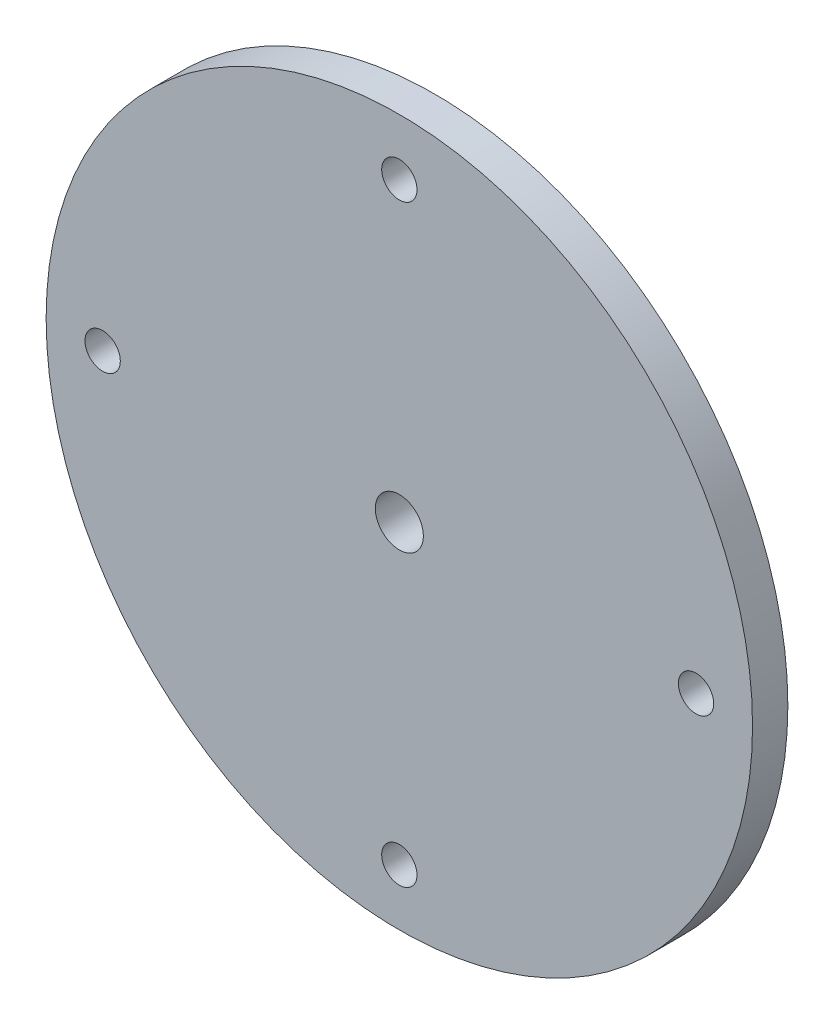
ISO-10303-21;
HEADER;
FILE_DESCRIPTION(('STEP AP214'),'2;1');
FILE_NAME('part.step','',(''),(''),'','','');
FILE_SCHEMA(('AUTOMOTIVE_DESIGN { 1 0 10303 214 1 1 1 1 }'));
ENDSEC;
DATA;
#1=APPLICATION_CONTEXT('core data for automotive mechanical design processes');
#2=APPLICATION_PROTOCOL_DEFINITION('international standard','automotive_design',2000,#1);
#3=PRODUCT_CONTEXT('',#1,'mechanical');
#4=PRODUCT('Part','Part','',(#3));
#5=PRODUCT_RELATED_PRODUCT_CATEGORY('part','',(#4));
#6=PRODUCT_DEFINITION_FORMATION('','',#4);
#7=PRODUCT_DEFINITION_CONTEXT('part definition',#1,'design');
#8=PRODUCT_DEFINITION('design','',#6,#7);
#9=PRODUCT_DEFINITION_SHAPE('','',#8);
#10=(LENGTH_UNIT() NAMED_UNIT(*) SI_UNIT(.MILLI.,.METRE.));
#11=(NAMED_UNIT(*) PLANE_ANGLE_UNIT() SI_UNIT($,.RADIAN.));
#12=(NAMED_UNIT(*) SI_UNIT($,.STERADIAN.) SOLID_ANGLE_UNIT());
#13=UNCERTAINTY_MEASURE_WITH_UNIT(LENGTH_MEASURE(1.E-05),#10,'distance_accuracy_value','');
#14=(GEOMETRIC_REPRESENTATION_CONTEXT(3) GLOBAL_UNCERTAINTY_ASSIGNED_CONTEXT((#13)) GLOBAL_UNIT_ASSIGNED_CONTEXT((#10,
#11,#12)) REPRESENTATION_CONTEXT('',''));
#15=CARTESIAN_POINT('',(0.,0.,0.));
#16=DIRECTION('',(0.,0.,1.));
#17=DIRECTION('',(1.,0.,0.));
#18=AXIS2_PLACEMENT_3D('',#15,#16,#17);
#19=CARTESIAN_POINT('',(0.,0.,2.));
#20=DIRECTION('',(0.,0.,-1.));
#21=DIRECTION('',(-1.,0.,0.));
#22=AXIS2_PLACEMENT_3D('',#19,#20,#21);
#23=CYLINDRICAL_SURFACE('',#22,14.);
#24=CARTESIAN_POINT('',(0.,0.,1.));
#25=DIRECTION('',(0.,0.,1.));
#26=DIRECTION('',(1.,0.,0.));
#27=AXIS2_PLACEMENT_3D('',#24,#25,#26);
#28=CIRCLE('',#27,14.);
#29=CARTESIAN_POINT('',(14.,0.,1.));
#30=VERTEX_POINT('',#29);
#31=EDGE_CURVE('E11',#30,#30,#28,.F.);
#32=ORIENTED_EDGE('',*,*,#31,.T.);
#33=EDGE_LOOP('',(#32));
#34=FACE_BOUND('',#33,.T.);
#35=CARTESIAN_POINT('',(0.,0.,0.));
#36=DIRECTION('',(0.,0.,1.));
#37=DIRECTION('',(1.,0.,0.));
#38=AXIS2_PLACEMENT_3D('',#35,#36,#37);
#39=CIRCLE('',#38,14.);
#40=CARTESIAN_POINT('',(14.,0.,0.));
#41=VERTEX_POINT('',#40);
#42=EDGE_CURVE('E123',#41,#41,#39,.T.);
#43=ORIENTED_EDGE('',*,*,#42,.T.);
#44=EDGE_LOOP('',(#43));
#45=FACE_BOUND('',#44,.T.);
#46=ADVANCED_FACE('F43',(#34,#45),#23,.T.);
#47=CARTESIAN_POINT('',(0.,0.,0.));
#48=DIRECTION('',(0.,0.,1.));
#49=DIRECTION('',(1.,0.,0.));
#50=AXIS2_PLACEMENT_3D('',#47,#48,#49);
#51=PLANE('',#50);
#52=ORIENTED_EDGE('',*,*,#42,.F.);
#53=EDGE_LOOP('',(#52));
#54=FACE_BOUND('',#53,.T.);
#55=CARTESIAN_POINT('',(0.,0.,0.));
#56=DIRECTION('',(0.,0.,1.));
#57=DIRECTION('',(1.,0.,0.));
#58=AXIS2_PLACEMENT_3D('',#55,#56,#57);
#59=CIRCLE('',#58,12.5);
#60=CARTESIAN_POINT('',(12.5,0.,0.));
#61=VERTEX_POINT('',#60);
#62=EDGE_CURVE('E113',#61,#61,#59,.T.);
#63=ORIENTED_EDGE('',*,*,#62,.T.);
#64=EDGE_LOOP('',(#63));
#65=FACE_BOUND('',#64,.T.);
#66=ADVANCED_FACE('F155',(#54,#65),#51,.F.);
#67=CARTESIAN_POINT('',(0.,0.,2.));
#68=DIRECTION('',(0.,0.,-1.));
#69=DIRECTION('',(-1.,0.,0.));
#70=AXIS2_PLACEMENT_3D('',#67,#68,#69);
#71=CYLINDRICAL_SURFACE('',#70,12.5);
#72=CARTESIAN_POINT('',(0.,0.,2.));
#73=DIRECTION('',(0.,0.,1.));
#74=DIRECTION('',(1.,0.,0.));
#75=AXIS2_PLACEMENT_3D('',#72,#73,#74);
#76=CIRCLE('',#75,12.5);
#77=CARTESIAN_POINT('',(8.83883476483185,8.83883476483184,2.));
#78=VERTEX_POINT('',#77);
#79=CARTESIAN_POINT('',(-8.83883476483185,8.83883476483184,2.));
#80=VERTEX_POINT('',#79);
#81=EDGE_CURVE('E119',#78,#80,#76,.T.);
#82=ORIENTED_EDGE('',*,*,#81,.T.);
#83=CARTESIAN_POINT('',(-8.83883476483185,-8.83883476483185,2.));
#84=VERTEX_POINT('',#83);
#85=EDGE_CURVE('E124',#80,#84,#76,.T.);
#86=ORIENTED_EDGE('',*,*,#85,.T.);
#87=CARTESIAN_POINT('',(8.83883476483184,-8.83883476483185,2.));
#88=VERTEX_POINT('',#87);
#89=EDGE_CURVE('E275',#84,#88,#76,.T.);
#90=ORIENTED_EDGE('',*,*,#89,.T.);
#91=EDGE_CURVE('E125',#88,#78,#76,.T.);
#92=ORIENTED_EDGE('',*,*,#91,.T.);
#93=EDGE_LOOP('',(#82,#86,#90,#92));
#94=FACE_BOUND('',#93,.T.);
#95=ORIENTED_EDGE('',*,*,#62,.F.);
#96=EDGE_LOOP('',(#95));
#97=FACE_BOUND('',#96,.T.);
#98=ADVANCED_FACE('F160',(#94,#97),#71,.F.);
#99=CARTESIAN_POINT('',(0.,0.,2.));
#100=DIRECTION('',(0.,0.,1.));
#101=DIRECTION('',(1.,0.,0.));
#102=AXIS2_PLACEMENT_3D('',#99,#100,#101);
#103=PLANE('',#102);
#104=ORIENTED_EDGE('',*,*,#81,.F.);
#105=DIRECTION('',(-1.,0.,0.));
#106=VECTOR('',#105,1.);
#107=CARTESIAN_POINT('',(-8.83883476483185,8.83883476483184,2.));
#108=LINE('',#107,#106);
#109=EDGE_CURVE('E262',#78,#80,#108,.T.);
#110=ORIENTED_EDGE('',*,*,#109,.T.);
#111=EDGE_LOOP('',(#104,#110));
#112=FACE_BOUND('',#111,.T.);
#113=ADVANCED_FACE('F167',(#112),#103,.F.);
#114=ORIENTED_EDGE('',*,*,#85,.F.);
#115=DIRECTION('',(0.,-1.,0.));
#116=VECTOR('',#115,1.);
#117=CARTESIAN_POINT('',(-8.83883476483185,-8.83883476483185,2.));
#118=LINE('',#117,#116);
#119=EDGE_CURVE('E106',#80,#84,#118,.T.);
#120=ORIENTED_EDGE('',*,*,#119,.T.);
#121=EDGE_LOOP('',(#114,#120));
#122=FACE_BOUND('',#121,.T.);
#123=ADVANCED_FACE('F284',(#122),#103,.F.);
#124=ORIENTED_EDGE('',*,*,#89,.F.);
#125=DIRECTION('',(1.,0.,0.));
#126=VECTOR('',#125,1.);
#127=CARTESIAN_POINT('',(-8.83883476483185,-8.83883476483185,2.));
#128=LINE('',#127,#126);
#129=EDGE_CURVE('E256',#84,#88,#128,.T.);
#130=ORIENTED_EDGE('',*,*,#129,.T.);
#131=EDGE_LOOP('',(#124,#130));
#132=FACE_BOUND('',#131,.T.);
#133=ADVANCED_FACE('F173',(#132),#103,.F.);
#134=ORIENTED_EDGE('',*,*,#91,.F.);
#135=DIRECTION('',(0.,1.,0.));
#136=VECTOR('',#135,1.);
#137=CARTESIAN_POINT('',(8.83883476483184,-8.83883476483185,2.));
#138=LINE('',#137,#136);
#139=EDGE_CURVE('E58',#88,#78,#138,.T.);
#140=ORIENTED_EDGE('',*,*,#139,.T.);
#141=EDGE_LOOP('',(#134,#140));
#142=FACE_BOUND('',#141,.T.);
#143=ADVANCED_FACE('F169',(#142),#103,.F.);
#144=CARTESIAN_POINT('',(8.83883476483184,-8.83883476483185,7.));
#145=DIRECTION('',(-1.,0.,0.));
#146=DIRECTION('',(0.,0.,1.));
#147=AXIS2_PLACEMENT_3D('',#144,#145,#146);
#148=PLANE('',#147);
#149=ORIENTED_EDGE('',*,*,#139,.F.);
#150=DIRECTION('',(0.,0.,-1.));
#151=VECTOR('',#150,1.);
#152=CARTESIAN_POINT('',(8.83883476483184,-8.83883476483185,7.));
#153=LINE('',#152,#151);
#154=CARTESIAN_POINT('',(8.83883476483184,-8.83883476483185,7.));
#155=VERTEX_POINT('',#154);
#156=EDGE_CURVE('E115',#155,#88,#153,.T.);
#157=ORIENTED_EDGE('',*,*,#156,.F.);
#158=DIRECTION('',(0.,1.,0.));
#159=VECTOR('',#158,1.);
#160=CARTESIAN_POINT('',(8.83883476483184,-8.83883476483185,7.));
#161=LINE('',#160,#159);
#162=CARTESIAN_POINT('',(8.83883476483184,8.83883476483184,7.));
#163=VERTEX_POINT('',#162);
#164=EDGE_CURVE('E102',#155,#163,#161,.T.);
#165=ORIENTED_EDGE('',*,*,#164,.T.);
#166=DIRECTION('',(0.,0.,-1.));
#167=VECTOR('',#166,1.);
#168=CARTESIAN_POINT('',(8.83883476483184,8.83883476483184,7.));
#169=LINE('',#168,#167);
#170=EDGE_CURVE('E100',#163,#78,#169,.T.);
#171=ORIENTED_EDGE('',*,*,#170,.T.);
#172=EDGE_LOOP('',(#149,#157,#165,#171));
#173=FACE_BOUND('',#172,.T.);
#174=ADVANCED_FACE('F172',(#173),#148,.T.);
#175=CARTESIAN_POINT('',(-8.83883476483185,8.83883476483184,7.));
#176=DIRECTION('',(0.,-1.,0.));
#177=DIRECTION('',(0.,0.,-1.));
#178=AXIS2_PLACEMENT_3D('',#175,#176,#177);
#179=PLANE('',#178);
#180=ORIENTED_EDGE('',*,*,#109,.F.);
#181=ORIENTED_EDGE('',*,*,#170,.F.);
#182=DIRECTION('',(-1.,0.,0.));
#183=VECTOR('',#182,1.);
#184=CARTESIAN_POINT('',(-8.83883476483185,8.83883476483184,7.));
#185=LINE('',#184,#183);
#186=CARTESIAN_POINT('',(-8.83883476483185,8.83883476483184,7.));
#187=VERTEX_POINT('',#186);
#188=EDGE_CURVE('E86',#163,#187,#185,.T.);
#189=ORIENTED_EDGE('',*,*,#188,.T.);
#190=DIRECTION('',(0.,0.,-1.));
#191=VECTOR('',#190,1.);
#192=CARTESIAN_POINT('',(-8.83883476483185,8.83883476483184,7.));
#193=LINE('',#192,#191);
#194=EDGE_CURVE('E98',#187,#80,#193,.T.);
#195=ORIENTED_EDGE('',*,*,#194,.T.);
#196=EDGE_LOOP('',(#180,#181,#189,#195));
#197=FACE_BOUND('',#196,.T.);
#198=ADVANCED_FACE('F97',(#197),#179,.T.);
#199=CARTESIAN_POINT('',(-8.83883476483185,-8.83883476483185,7.));
#200=DIRECTION('',(1.,0.,0.));
#201=DIRECTION('',(0.,0.,-1.));
#202=AXIS2_PLACEMENT_3D('',#199,#200,#201);
#203=PLANE('',#202);
#204=ORIENTED_EDGE('',*,*,#119,.F.);
#205=ORIENTED_EDGE('',*,*,#194,.F.);
#206=DIRECTION('',(0.,-1.,0.));
#207=VECTOR('',#206,1.);
#208=CARTESIAN_POINT('',(-8.83883476483185,-8.83883476483185,7.));
#209=LINE('',#208,#207);
#210=CARTESIAN_POINT('',(-8.83883476483185,-8.83883476483185,7.));
#211=VERTEX_POINT('',#210);
#212=EDGE_CURVE('E83',#187,#211,#209,.T.);
#213=ORIENTED_EDGE('',*,*,#212,.T.);
#214=DIRECTION('',(0.,0.,-1.));
#215=VECTOR('',#214,1.);
#216=CARTESIAN_POINT('',(-8.83883476483185,-8.83883476483185,7.));
#217=LINE('',#216,#215);
#218=EDGE_CURVE('E109',#211,#84,#217,.T.);
#219=ORIENTED_EDGE('',*,*,#218,.T.);
#220=EDGE_LOOP('',(#204,#205,#213,#219));
#221=FACE_BOUND('',#220,.T.);
#222=ADVANCED_FACE('F104',(#221),#203,.T.);
#223=CARTESIAN_POINT('',(-8.83883476483185,-8.83883476483185,7.));
#224=DIRECTION('',(0.,1.,0.));
#225=DIRECTION('',(0.,0.,1.));
#226=AXIS2_PLACEMENT_3D('',#223,#224,#225);
#227=PLANE('',#226);
#228=ORIENTED_EDGE('',*,*,#129,.F.);
#229=ORIENTED_EDGE('',*,*,#218,.F.);
#230=DIRECTION('',(1.,0.,0.));
#231=VECTOR('',#230,1.);
#232=CARTESIAN_POINT('',(-8.83883476483185,-8.83883476483185,7.));
#233=LINE('',#232,#231);
#234=EDGE_CURVE('E66',#211,#155,#233,.T.);
#235=ORIENTED_EDGE('',*,*,#234,.T.);
#236=ORIENTED_EDGE('',*,*,#156,.T.);
#237=EDGE_LOOP('',(#228,#229,#235,#236));
#238=FACE_BOUND('',#237,.T.);
#239=ADVANCED_FACE('F181',(#238),#227,.T.);
#240=CARTESIAN_POINT('',(0.,0.,7.));
#241=DIRECTION('',(0.,0.,1.));
#242=DIRECTION('',(1.,0.,0.));
#243=AXIS2_PLACEMENT_3D('',#240,#241,#242);
#244=PLANE('',#243);
#245=CARTESIAN_POINT('',(0.,0.,7.));
#246=DIRECTION('',(0.,0.,1.));
#247=DIRECTION('',(1.,0.,0.));
#248=AXIS2_PLACEMENT_3D('',#245,#246,#247);
#249=CIRCLE('',#248,3.39999999999999);
#250=CARTESIAN_POINT('',(3.39999999999999,0.,7.));
#251=VERTEX_POINT('',#250);
#252=EDGE_CURVE('E243',#251,#251,#249,.T.);
#253=ORIENTED_EDGE('',*,*,#252,.T.);
#254=EDGE_LOOP('',(#253));
#255=FACE_BOUND('',#254,.T.);
#256=ORIENTED_EDGE('',*,*,#188,.F.);
#257=ORIENTED_EDGE('',*,*,#164,.F.);
#258=ORIENTED_EDGE('',*,*,#234,.F.);
#259=ORIENTED_EDGE('',*,*,#212,.F.);
#260=EDGE_LOOP('',(#256,#257,#258,#259));
#261=FACE_BOUND('',#260,.T.);
#262=ADVANCED_FACE('F85',(#255,#261),#244,.F.);
#263=CARTESIAN_POINT('',(0.,0.,7.));
#264=DIRECTION('',(0.,0.,1.));
#265=DIRECTION('',(1.,0.,0.));
#266=AXIS2_PLACEMENT_3D('',#263,#264,#265);
#267=CYLINDRICAL_SURFACE('',#266,50.);
#268=CARTESIAN_POINT('',(0.,0.,7.));
#269=DIRECTION('',(0.,0.,1.));
#270=DIRECTION('',(1.,0.,0.));
#271=AXIS2_PLACEMENT_3D('',#268,#269,#270);
#272=CIRCLE('',#271,50.);
#273=CARTESIAN_POINT('',(50.,0.,7.));
#274=VERTEX_POINT('',#273);
#275=EDGE_CURVE('E248',#274,#274,#272,.T.);
#276=ORIENTED_EDGE('',*,*,#275,.T.);
#277=EDGE_LOOP('',(#276));
#278=FACE_BOUND('',#277,.T.);
#279=CARTESIAN_POINT('',(0.,0.,12.));
#280=DIRECTION('',(0.,0.,1.));
#281=DIRECTION('',(1.,0.,0.));
#282=AXIS2_PLACEMENT_3D('',#279,#280,#281);
#283=CIRCLE('',#282,50.);
#284=CARTESIAN_POINT('',(50.,0.,12.));
#285=VERTEX_POINT('',#284);
#286=EDGE_CURVE('E247',#285,#285,#283,.T.);
#287=ORIENTED_EDGE('',*,*,#286,.F.);
#288=EDGE_LOOP('',(#287));
#289=FACE_BOUND('',#288,.T.);
#290=ADVANCED_FACE('F187',(#278,#289),#267,.T.);
#291=CARTESIAN_POINT('',(0.,0.,7.));
#292=DIRECTION('',(0.,0.,1.));
#293=DIRECTION('',(1.,0.,0.));
#294=AXIS2_PLACEMENT_3D('',#291,#292,#293);
#295=PLANE('',#294);
#296=CARTESIAN_POINT('',(0.,0.,7.));
#297=DIRECTION('',(0.,0.,1.));
#298=DIRECTION('',(1.,0.,0.));
#299=AXIS2_PLACEMENT_3D('',#296,#297,#298);
#300=CIRCLE('',#299,20.);
#301=CARTESIAN_POINT('',(20.,0.,7.));
#302=VERTEX_POINT('',#301);
#303=EDGE_CURVE('E52',#302,#302,#300,.T.);
#304=ORIENTED_EDGE('',*,*,#303,.T.);
#305=EDGE_LOOP('',(#304));
#306=FACE_BOUND('',#305,.T.);
#307=CARTESIAN_POINT('',(0.,42.,7.));
#308=DIRECTION('',(0.,0.,1.));
#309=DIRECTION('',(1.,0.,0.));
#310=AXIS2_PLACEMENT_3D('',#307,#308,#309);
#311=CIRCLE('',#310,2.49999999999999);
#312=CARTESIAN_POINT('',(2.49999999999999,42.,7.));
#313=VERTEX_POINT('',#312);
#314=EDGE_CURVE('E228',#313,#313,#311,.T.);
#315=ORIENTED_EDGE('',*,*,#314,.T.);
#316=EDGE_LOOP('',(#315));
#317=FACE_BOUND('',#316,.T.);
#318=CARTESIAN_POINT('',(42.,0.,7.));
#319=DIRECTION('',(0.,0.,1.));
#320=DIRECTION('',(1.,0.,0.));
#321=AXIS2_PLACEMENT_3D('',#318,#319,#320);
#322=CIRCLE('',#321,2.49999999999999);
#323=CARTESIAN_POINT('',(44.5,0.,7.));
#324=VERTEX_POINT('',#323);
#325=EDGE_CURVE('E220',#324,#324,#322,.T.);
#326=ORIENTED_EDGE('',*,*,#325,.T.);
#327=EDGE_LOOP('',(#326));
#328=FACE_BOUND('',#327,.T.);
#329=CARTESIAN_POINT('',(0.,-42.,7.));
#330=DIRECTION('',(0.,0.,1.));
#331=DIRECTION('',(1.,0.,0.));
#332=AXIS2_PLACEMENT_3D('',#329,#330,#331);
#333=CIRCLE('',#332,2.49999999999999);
#334=CARTESIAN_POINT('',(2.49999999999999,-42.,7.));
#335=VERTEX_POINT('',#334);
#336=EDGE_CURVE('E132',#335,#335,#333,.T.);
#337=ORIENTED_EDGE('',*,*,#336,.T.);
#338=EDGE_LOOP('',(#337));
#339=FACE_BOUND('',#338,.T.);
#340=CARTESIAN_POINT('',(-42.,0.,7.));
#341=DIRECTION('',(0.,0.,1.));
#342=DIRECTION('',(1.,0.,0.));
#343=AXIS2_PLACEMENT_3D('',#340,#341,#342);
#344=CIRCLE('',#343,2.49999999999999);
#345=CARTESIAN_POINT('',(-39.5,0.,7.));
#346=VERTEX_POINT('',#345);
#347=EDGE_CURVE('E235',#346,#346,#344,.T.);
#348=ORIENTED_EDGE('',*,*,#347,.T.);
#349=EDGE_LOOP('',(#348));
#350=FACE_BOUND('',#349,.T.);
#351=ORIENTED_EDGE('',*,*,#275,.F.);
#352=EDGE_LOOP('',(#351));
#353=FACE_BOUND('',#352,.T.);
#354=ADVANCED_FACE('F141',(#306,#317,#328,#339,#350,#353),#295,.F.);
#355=CARTESIAN_POINT('',(0.,0.,12.));
#356=DIRECTION('',(0.,0.,1.));
#357=DIRECTION('',(1.,0.,0.));
#358=AXIS2_PLACEMENT_3D('',#355,#356,#357);
#359=PLANE('',#358);
#360=CARTESIAN_POINT('',(0.,42.,12.));
#361=DIRECTION('',(0.,0.,1.));
#362=DIRECTION('',(1.,0.,0.));
#363=AXIS2_PLACEMENT_3D('',#360,#361,#362);
#364=CIRCLE('',#363,2.49999999999999);
#365=CARTESIAN_POINT('',(2.49999999999999,42.,12.));
#366=VERTEX_POINT('',#365);
#367=EDGE_CURVE('E477',#366,#366,#364,.T.);
#368=ORIENTED_EDGE('',*,*,#367,.F.);
#369=EDGE_LOOP('',(#368));
#370=FACE_BOUND('',#369,.T.);
#371=CARTESIAN_POINT('',(42.,0.,12.));
#372=DIRECTION('',(0.,0.,1.));
#373=DIRECTION('',(1.,0.,0.));
#374=AXIS2_PLACEMENT_3D('',#371,#372,#373);
#375=CIRCLE('',#374,2.49999999999999);
#376=CARTESIAN_POINT('',(44.5,0.,12.));
#377=VERTEX_POINT('',#376);
#378=EDGE_CURVE('E217',#377,#377,#375,.T.);
#379=ORIENTED_EDGE('',*,*,#378,.F.);
#380=EDGE_LOOP('',(#379));
#381=FACE_BOUND('',#380,.T.);
#382=CARTESIAN_POINT('',(0.,-42.,12.));
#383=DIRECTION('',(0.,0.,1.));
#384=DIRECTION('',(1.,0.,0.));
#385=AXIS2_PLACEMENT_3D('',#382,#383,#384);
#386=CIRCLE('',#385,2.49999999999999);
#387=CARTESIAN_POINT('',(2.49999999999999,-42.,12.));
#388=VERTEX_POINT('',#387);
#389=EDGE_CURVE('E136',#388,#388,#386,.T.);
#390=ORIENTED_EDGE('',*,*,#389,.F.);
#391=EDGE_LOOP('',(#390));
#392=FACE_BOUND('',#391,.T.);
#393=CARTESIAN_POINT('',(-42.,0.,12.));
#394=DIRECTION('',(0.,0.,1.));
#395=DIRECTION('',(1.,0.,0.));
#396=AXIS2_PLACEMENT_3D('',#393,#394,#395);
#397=CIRCLE('',#396,2.49999999999999);
#398=CARTESIAN_POINT('',(-39.5,0.,12.));
#399=VERTEX_POINT('',#398);
#400=EDGE_CURVE('E135',#399,#399,#397,.T.);
#401=ORIENTED_EDGE('',*,*,#400,.F.);
#402=EDGE_LOOP('',(#401));
#403=FACE_BOUND('',#402,.T.);
#404=CARTESIAN_POINT('',(0.,0.,12.));
#405=DIRECTION('',(0.,0.,1.));
#406=DIRECTION('',(1.,0.,0.));
#407=AXIS2_PLACEMENT_3D('',#404,#405,#406);
#408=CIRCLE('',#407,3.39999999999999);
#409=CARTESIAN_POINT('',(3.39999999999999,0.,12.));
#410=VERTEX_POINT('',#409);
#411=EDGE_CURVE('E239',#410,#410,#408,.T.);
#412=ORIENTED_EDGE('',*,*,#411,.F.);
#413=EDGE_LOOP('',(#412));
#414=FACE_BOUND('',#413,.T.);
#415=ORIENTED_EDGE('',*,*,#286,.T.);
#416=EDGE_LOOP('',(#415));
#417=FACE_BOUND('',#416,.T.);
#418=ADVANCED_FACE('F189',(#370,#381,#392,#403,#414,#417),#359,.T.);
#419=CARTESIAN_POINT('',(0.,0.,12.));
#420=DIRECTION('',(0.,0.,1.));
#421=DIRECTION('',(1.,0.,0.));
#422=AXIS2_PLACEMENT_3D('',#419,#420,#421);
#423=CYLINDRICAL_SURFACE('',#422,3.39999999999999);
#424=ORIENTED_EDGE('',*,*,#411,.T.);
#425=EDGE_LOOP('',(#424));
#426=FACE_BOUND('',#425,.T.);
#427=ORIENTED_EDGE('',*,*,#252,.F.);
#428=EDGE_LOOP('',(#427));
#429=FACE_BOUND('',#428,.T.);
#430=ADVANCED_FACE('F192',(#426,#429),#423,.F.);
#431=CARTESIAN_POINT('',(-42.,0.,12.));
#432=DIRECTION('',(0.,0.,1.));
#433=DIRECTION('',(1.,0.,0.));
#434=AXIS2_PLACEMENT_3D('',#431,#432,#433);
#435=CYLINDRICAL_SURFACE('',#434,2.49999999999999);
#436=ORIENTED_EDGE('',*,*,#400,.T.);
#437=EDGE_LOOP('',(#436));
#438=FACE_BOUND('',#437,.T.);
#439=ORIENTED_EDGE('',*,*,#347,.F.);
#440=EDGE_LOOP('',(#439));
#441=FACE_BOUND('',#440,.T.);
#442=ADVANCED_FACE('F201',(#438,#441),#435,.F.);
#443=CARTESIAN_POINT('',(0.,-42.,12.));
#444=DIRECTION('',(0.,0.,1.));
#445=DIRECTION('',(1.,0.,0.));
#446=AXIS2_PLACEMENT_3D('',#443,#444,#445);
#447=CYLINDRICAL_SURFACE('',#446,2.49999999999999);
#448=ORIENTED_EDGE('',*,*,#389,.T.);
#449=EDGE_LOOP('',(#448));
#450=FACE_BOUND('',#449,.T.);
#451=ORIENTED_EDGE('',*,*,#336,.F.);
#452=EDGE_LOOP('',(#451));
#453=FACE_BOUND('',#452,.T.);
#454=ADVANCED_FACE('F205',(#450,#453),#447,.F.);
#455=CARTESIAN_POINT('',(42.,0.,12.));
#456=DIRECTION('',(0.,0.,1.));
#457=DIRECTION('',(1.,0.,0.));
#458=AXIS2_PLACEMENT_3D('',#455,#456,#457);
#459=CYLINDRICAL_SURFACE('',#458,2.49999999999999);
#460=ORIENTED_EDGE('',*,*,#378,.T.);
#461=EDGE_LOOP('',(#460));
#462=FACE_BOUND('',#461,.T.);
#463=ORIENTED_EDGE('',*,*,#325,.F.);
#464=EDGE_LOOP('',(#463));
#465=FACE_BOUND('',#464,.T.);
#466=ADVANCED_FACE('F150',(#462,#465),#459,.F.);
#467=CARTESIAN_POINT('',(0.,42.,12.));
#468=DIRECTION('',(0.,0.,1.));
#469=DIRECTION('',(1.,0.,0.));
#470=AXIS2_PLACEMENT_3D('',#467,#468,#469);
#471=CYLINDRICAL_SURFACE('',#470,2.49999999999999);
#472=ORIENTED_EDGE('',*,*,#367,.T.);
#473=EDGE_LOOP('',(#472));
#474=FACE_BOUND('',#473,.T.);
#475=ORIENTED_EDGE('',*,*,#314,.F.);
#476=EDGE_LOOP('',(#475));
#477=FACE_BOUND('',#476,.T.);
#478=ADVANCED_FACE('F145',(#474,#477),#471,.F.);
#479=CARTESIAN_POINT('',(0.,0.,1.));
#480=DIRECTION('',(0.,0.,1.));
#481=DIRECTION('',(1.,0.,0.));
#482=AXIS2_PLACEMENT_3D('',#479,#480,#481);
#483=TOROIDAL_SURFACE('',#482,20.,6.);
#484=ORIENTED_EDGE('',*,*,#31,.F.);
#485=EDGE_LOOP('',(#484));
#486=FACE_BOUND('',#485,.T.);
#487=ORIENTED_EDGE('',*,*,#303,.F.);
#488=EDGE_LOOP('',(#487));
#489=FACE_BOUND('',#488,.T.);
#490=ADVANCED_FACE('F45',(#486,#489),#483,.F.);
#491=CLOSED_SHELL('',(#46,#66,#98,#113,#123,#133,#143,#174,#198,#222,#239,#262,#290,#354,#418,
#430,#442,#454,#466,#478,#490));
#492=MANIFOLD_SOLID_BREP('B2',#491);
#493=ADVANCED_BREP_SHAPE_REPRESENTATION('',(#18,#492),#14);
#494=SHAPE_DEFINITION_REPRESENTATION(#9,#493);
ENDSEC;
END-ISO-10303-21;
